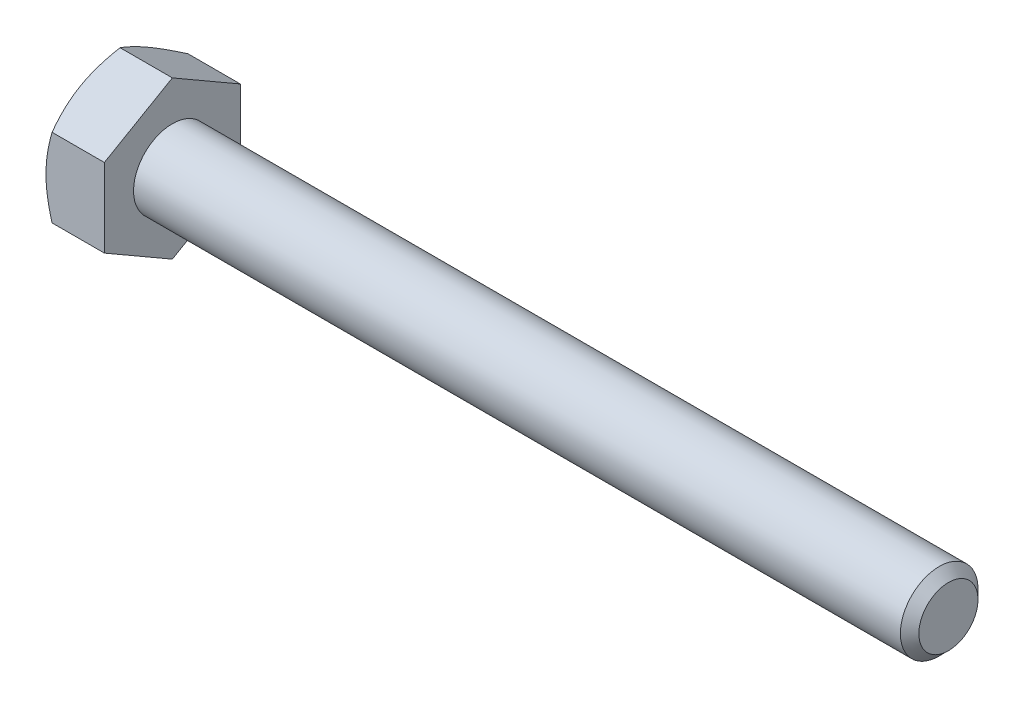
ISO-10303-21;
HEADER;
FILE_DESCRIPTION(('STEP AP214'),'2;1');
FILE_NAME('part.step','',(''),(''),'','','');
FILE_SCHEMA(('AUTOMOTIVE_DESIGN { 1 0 10303 214 1 1 1 1 }'));
ENDSEC;
DATA;
#1=APPLICATION_CONTEXT('core data for automotive mechanical design processes');
#2=APPLICATION_PROTOCOL_DEFINITION('international standard','automotive_design',2000,#1);
#3=PRODUCT_CONTEXT('',#1,'mechanical');
#4=PRODUCT('Part','Part','',(#3));
#5=PRODUCT_RELATED_PRODUCT_CATEGORY('part','',(#4));
#6=PRODUCT_DEFINITION_FORMATION('','',#4);
#7=PRODUCT_DEFINITION_CONTEXT('part definition',#1,'design');
#8=PRODUCT_DEFINITION('design','',#6,#7);
#9=PRODUCT_DEFINITION_SHAPE('','',#8);
#10=(LENGTH_UNIT() NAMED_UNIT(*) SI_UNIT(.MILLI.,.METRE.));
#11=(NAMED_UNIT(*) PLANE_ANGLE_UNIT() SI_UNIT($,.RADIAN.));
#12=(NAMED_UNIT(*) SI_UNIT($,.STERADIAN.) SOLID_ANGLE_UNIT());
#13=UNCERTAINTY_MEASURE_WITH_UNIT(LENGTH_MEASURE(1.E-05),#10,'distance_accuracy_value','');
#14=(GEOMETRIC_REPRESENTATION_CONTEXT(3) GLOBAL_UNCERTAINTY_ASSIGNED_CONTEXT((#13)) GLOBAL_UNIT_ASSIGNED_CONTEXT((#10,
#11,#12)) REPRESENTATION_CONTEXT('',''));
#15=CARTESIAN_POINT('',(0.,0.,0.));
#16=DIRECTION('',(0.,0.,1.));
#17=DIRECTION('',(1.,0.,0.));
#18=AXIS2_PLACEMENT_3D('',#15,#16,#17);
#19=CARTESIAN_POINT('',(4.7752,3.21156860739421,-5.5626));
#20=DIRECTION('',(0.,-0.866025403784438,0.500000000000001));
#21=DIRECTION('',(0.,-0.500000000000001,-0.866025403784438));
#22=AXIS2_PLACEMENT_3D('',#19,#20,#21);
#23=PLANE('',#22);
#24=CARTESIAN_POINT('',(0.496898061070143,6.42325268484227,0.0002));
#25=CARTESIAN_POINT('',(0.45614620225513,6.35265858120791,-0.122072574209491));
#26=CARTESIAN_POINT('',(0.417243775308723,6.2818012683745,-0.244801040124762));
#27=CARTESIAN_POINT('',(0.343647161560542,6.13951120287093,-0.491254662989243));
#28=CARTESIAN_POINT('',(0.308954790139044,6.06807821602765,-0.614980225538197));
#29=CARTESIAN_POINT('',(0.211873701066855,5.85263550648139,-0.98813794459262));
#30=CARTESIAN_POINT('',(0.156654841923373,5.70777535201369,-1.23904309212296));
#31=CARTESIAN_POINT('',(0.0919037861815275,5.49099476252075,-1.61451808721946));
#32=CARTESIAN_POINT('',(0.0734579983429333,5.41972205873199,-1.7379660313744));
#33=CARTESIAN_POINT('',(0.0425268916674615,5.27685459691414,-1.98541973399132));
#34=CARTESIAN_POINT('',(0.030041046189008,5.20525986790488,-2.10942544218948));
#35=CARTESIAN_POINT('',(0.0113480299394708,5.06194605565757,-2.35765224642821));
#36=CARTESIAN_POINT('',(0.00513373340584708,4.9902272065059,-2.48187293701928));
#37=CARTESIAN_POINT('',(-0.000889599359095551,4.84672720555795,-2.7304222295473));
#38=CARTESIAN_POINT('',(-0.000698833448296274,4.7749460557547,-2.85475082803225));
#39=CARTESIAN_POINT('',(0.00862810136342285,4.57828637012706,-3.19537539533985));
#40=CARTESIAN_POINT('',(0.0242873955350757,4.4534722013835,-3.41155987710816));
#41=CARTESIAN_POINT('',(0.0739443233816052,4.20467287416474,-3.84249295274001));
#42=CARTESIAN_POINT('',(0.107958931423458,4.08068859075412,-4.05724003094723));
#43=CARTESIAN_POINT('',(0.192986041409677,3.83138850679899,-4.4890404426887));
#44=CARTESIAN_POINT('',(0.244358813937401,3.70610416511176,-4.70603928788379));
#45=CARTESIAN_POINT('',(0.360954456999593,3.45740388365365,-5.13680081122592));
#46=CARTESIAN_POINT('',(0.426149937617058,3.33398475856357,-5.35056900650764));
#47=CARTESIAN_POINT('',(0.496898061070137,3.21145313734037,-5.5628));
#48=B_SPLINE_CURVE_WITH_KNOTS('',3,(#24,#25,#26,#27,#28,#29,#30,#31,#32,#33,#34,#35,#36,#37,#38,
#39,#40,#41,#42,#43,#44,#45,#46,#47),.UNSPECIFIED.,.F.,.F.,(4,2,2,2,2,2,2,2,2,2,2,4),(0.,
0.44082011856227,0.8818296488474,1.76568130465017,2.19678242164486,2.62784543796583,
3.05841812523868,3.48897751176353,4.23854798324166,4.98881282275669,5.75571809391027,
6.52111769989992),.UNSPECIFIED.);
#49=CARTESIAN_POINT('',(0.496831392605788,6.42313721478843,0.));
#50=VERTEX_POINT('',#49);
#51=CARTESIAN_POINT('',(0.,4.81735291109131,-2.78130000000001));
#52=VERTEX_POINT('',#51);
#53=EDGE_CURVE('E60',#50,#52,#48,.T.);
#54=ORIENTED_EDGE('',*,*,#53,.F.);
#55=DIRECTION('',(-1.,0.,0.));
#56=VECTOR('',#55,1.);
#57=CARTESIAN_POINT('',(4.7752,6.42313721478843,0.));
#58=LINE('',#57,#56);
#59=CARTESIAN_POINT('',(4.7752,6.42313721478843,0.));
#60=VERTEX_POINT('',#59);
#61=EDGE_CURVE('E169',#60,#50,#58,.T.);
#62=ORIENTED_EDGE('',*,*,#61,.F.);
#63=DIRECTION('',(0.,0.500000000000001,0.866025403784438));
#64=VECTOR('',#63,1.);
#65=CARTESIAN_POINT('',(4.7752,3.21156860739421,-5.5626));
#66=LINE('',#65,#64);
#67=CARTESIAN_POINT('',(4.7752,3.21156860739421,-5.5626));
#68=VERTEX_POINT('',#67);
#69=EDGE_CURVE('E271',#68,#60,#66,.T.);
#70=ORIENTED_EDGE('',*,*,#69,.F.);
#71=DIRECTION('',(-1.,0.,0.));
#72=VECTOR('',#71,1.);
#73=CARTESIAN_POINT('',(4.7752,3.21156860739421,-5.5626));
#74=LINE('',#73,#72);
#75=CARTESIAN_POINT('',(0.496831392605783,3.21156860739421,-5.5626));
#76=VERTEX_POINT('',#75);
#77=EDGE_CURVE('E154',#68,#76,#74,.T.);
#78=ORIENTED_EDGE('',*,*,#77,.T.);
#79=EDGE_CURVE('E148',#52,#76,#48,.T.);
#80=ORIENTED_EDGE('',*,*,#79,.F.);
#81=EDGE_LOOP('',(#54,#62,#70,#78,#80));
#82=FACE_BOUND('',#81,.T.);
#83=ADVANCED_FACE('F40',(#82),#23,.F.);
#84=CARTESIAN_POINT('',(4.7752,6.42313721478843,0.));
#85=DIRECTION('',(0.,-0.866025403784438,-0.500000000000001));
#86=DIRECTION('',(0.,0.500000000000001,-0.866025403784438));
#87=AXIS2_PLACEMENT_3D('',#84,#85,#86);
#88=PLANE('',#87);
#89=CARTESIAN_POINT('',(0.496898061070137,3.21145313734037,5.5628));
#90=CARTESIAN_POINT('',(0.456146202255126,3.28204724097473,5.44052742579051));
#91=CARTESIAN_POINT('',(0.417243775308719,3.35290455380814,5.31779895987524));
#92=CARTESIAN_POINT('',(0.343647161560538,3.49519461931171,5.07134533701076));
#93=CARTESIAN_POINT('',(0.30895479013904,3.56662760615498,4.9476197744618));
#94=CARTESIAN_POINT('',(0.211873701066851,3.78207031570124,4.57446205540738));
#95=CARTESIAN_POINT('',(0.156654841923371,3.92693047016895,4.32355690787704));
#96=CARTESIAN_POINT('',(0.0919037861815261,4.14371105966188,3.94808191278055));
#97=CARTESIAN_POINT('',(0.0734579983429319,4.21498376345064,3.82463396862561));
#98=CARTESIAN_POINT('',(0.0425268916674603,4.35785122526849,3.57718026600868));
#99=CARTESIAN_POINT('',(0.0300410461890069,4.42944595427775,3.45317455781052));
#100=CARTESIAN_POINT('',(0.0113480299394699,4.57275976652506,3.20494775357179));
#101=CARTESIAN_POINT('',(0.00513373340584611,4.64447861567674,3.08072706298073));
#102=CARTESIAN_POINT('',(-0.000889599359095831,4.78797861662468,2.8321777704527));
#103=CARTESIAN_POINT('',(-0.000698833448295828,4.85975976642794,2.70784917196775));
#104=CARTESIAN_POINT('',(0.00862810136342449,5.05641945205558,2.36722460466016));
#105=CARTESIAN_POINT('',(0.0242873955350772,5.18123362079914,2.15104012289184));
#106=CARTESIAN_POINT('',(0.0739443233816073,5.4300329480179,1.72010704725999));
#107=CARTESIAN_POINT('',(0.107958931423461,5.55401723142852,1.50535996905277));
#108=CARTESIAN_POINT('',(0.19298604140968,5.80331731538365,1.0735595573113));
#109=CARTESIAN_POINT('',(0.244358813937405,5.92860165707088,0.856560712116213));
#110=CARTESIAN_POINT('',(0.360954456999597,6.17730193852899,0.425799188774084));
#111=CARTESIAN_POINT('',(0.426149937617063,6.30072106361907,0.212030993492364));
#112=CARTESIAN_POINT('',(0.496898061070143,6.42325268484227,-0.000200000000000001));
#113=B_SPLINE_CURVE_WITH_KNOTS('',3,(#89,#90,#91,#92,#93,#94,#95,#96,#97,#98,#99,#100,#101,#102,
#103,#104,#105,#106,#107,#108,#109,#110,#111,#112),.UNSPECIFIED.,.F.,.F.,(4,2,2,2,2,2,2,2,2,2,2,
4),(0.,0.440820118562269,0.881829648847399,1.76568130465016,2.19678242164486,2.62784543796582,
3.05841812523867,3.48897751176352,4.23854798324166,4.98881282275669,5.75571809391027,
6.52111769989992),.UNSPECIFIED.);
#114=CARTESIAN_POINT('',(0.496831392605783,3.21156860739421,5.5626));
#115=VERTEX_POINT('',#114);
#116=CARTESIAN_POINT('',(0.,4.81735291109131,2.78130000000001));
#117=VERTEX_POINT('',#116);
#118=EDGE_CURVE('E67',#115,#117,#113,.T.);
#119=ORIENTED_EDGE('',*,*,#118,.F.);
#120=DIRECTION('',(-1.,0.,0.));
#121=VECTOR('',#120,1.);
#122=CARTESIAN_POINT('',(4.7752,3.21156860739421,5.5626));
#123=LINE('',#122,#121);
#124=CARTESIAN_POINT('',(4.7752,3.21156860739421,5.5626));
#125=VERTEX_POINT('',#124);
#126=EDGE_CURVE('E166',#125,#115,#123,.T.);
#127=ORIENTED_EDGE('',*,*,#126,.F.);
#128=DIRECTION('',(0.,-0.500000000000001,0.866025403784438));
#129=VECTOR('',#128,1.);
#130=CARTESIAN_POINT('',(4.7752,6.42313721478843,0.));
#131=LINE('',#130,#129);
#132=EDGE_CURVE('E268',#60,#125,#131,.T.);
#133=ORIENTED_EDGE('',*,*,#132,.F.);
#134=ORIENTED_EDGE('',*,*,#61,.T.);
#135=EDGE_CURVE('E196',#117,#50,#113,.T.);
#136=ORIENTED_EDGE('',*,*,#135,.F.);
#137=EDGE_LOOP('',(#119,#127,#133,#134,#136));
#138=FACE_BOUND('',#137,.T.);
#139=ADVANCED_FACE('F202',(#138),#88,.F.);
#140=CARTESIAN_POINT('',(4.7752,3.21156860739421,5.5626));
#141=DIRECTION('',(0.,0.,-1.));
#142=DIRECTION('',(0.,1.,0.));
#143=AXIS2_PLACEMENT_3D('',#140,#141,#142);
#144=PLANE('',#143);
#145=CARTESIAN_POINT('',(2.76946298300578,-8.7393190750818,5.5626));
#146=CARTESIAN_POINT('',(2.65067477861527,-8.49536496655185,5.5626));
#147=CARTESIAN_POINT('',(2.53299354463682,-8.25086273482907,5.5626));
#148=CARTESIAN_POINT('',(2.30046552472367,-7.7604709003827,5.5626));
#149=CARTESIAN_POINT('',(2.18561916460972,-7.51458109596807,5.5626));
#150=CARTESIAN_POINT('',(1.9588276573177,-7.01990967875911,5.5626));
#151=CARTESIAN_POINT('',(1.84690075513499,-6.77111967311546,5.5626));
#152=CARTESIAN_POINT('',(1.62748022476041,-6.27159952967086,5.5626));
#153=CARTESIAN_POINT('',(1.51998639425647,-6.02086948102923,5.5626));
#154=CARTESIAN_POINT('',(1.30708686388974,-5.50862062722722,5.5626));
#155=CARTESIAN_POINT('',(1.20187213532634,-5.24702202923404,5.5626));
#156=CARTESIAN_POINT('',(0.999136459179914,-4.72080610855177,5.5626));
#157=CARTESIAN_POINT('',(0.901616358819185,-4.45618845710902,5.5626));
#158=CARTESIAN_POINT('',(0.716747077259983,-3.92397402708936,5.5626));
#159=CARTESIAN_POINT('',(0.629378259967496,-3.65638413524642,5.5626));
#160=CARTESIAN_POINT('',(0.467540995587162,-3.11736467473257,5.5626));
#161=CARTESIAN_POINT('',(0.393068604009403,-2.84593630766607,5.5626));
#162=CARTESIAN_POINT('',(0.260913640631057,-2.30059524064209,5.5626));
#163=CARTESIAN_POINT('',(0.203137923936712,-2.02670547200284,5.5626));
#164=CARTESIAN_POINT('',(0.107584140927259,-1.47536640564423,5.5626));
#165=CARTESIAN_POINT('',(0.0698039297389937,-1.19791749297778,5.5626));
#166=CARTESIAN_POINT('',(0.0306329032322198,-0.782024036094212,5.5626));
#167=CARTESIAN_POINT('',(0.0205033243625241,-0.644369602420743,5.5626));
#168=CARTESIAN_POINT('',(0.00607539244269754,-0.368760083391723,5.5626));
#169=CARTESIAN_POINT('',(0.00177648777087112,-0.230805027714104,5.5626));
#170=CARTESIAN_POINT('',(-0.000882415982739105,0.0451740127451351,5.5626));
#171=CARTESIAN_POINT('',(0.000758104232646437,0.183198002498892,5.5626));
#172=CARTESIAN_POINT('',(0.0099357013266243,0.459040079963629,5.5626));
#173=CARTESIAN_POINT('',(0.017472551860389,0.596858175374894,5.5626));
#174=CARTESIAN_POINT('',(0.0422505229084576,0.924672768817545,5.5626));
#175=CARTESIAN_POINT('',(0.0620998983879061,1.11447655248114,5.5626));
#176=CARTESIAN_POINT('',(0.111925243816852,1.49274006022234,5.5626));
#177=CARTESIAN_POINT('',(0.141902493413722,1.68119961138342,5.5626));
#178=CARTESIAN_POINT('',(0.24544179513394,2.24430469271528,5.5626));
#179=CARTESIAN_POINT('',(0.332595182135706,2.61648784181075,5.5626));
#180=CARTESIAN_POINT('',(0.484580657527375,3.17327423362328,5.5626));
#181=CARTESIAN_POINT('',(0.53953514834987,3.3607403414357,5.5626));
#182=CARTESIAN_POINT('',(0.655361857948686,3.73385345534553,5.5626));
#183=CARTESIAN_POINT('',(0.716234121733455,3.91950044759557,5.5626));
#184=CARTESIAN_POINT('',(0.842902269493743,4.28903174270243,5.5626));
#185=CARTESIAN_POINT('',(0.908696734383907,4.47291653649099,5.5626));
#186=CARTESIAN_POINT('',(1.04441413366768,4.83914665056041,5.5626));
#187=CARTESIAN_POINT('',(1.11433697738278,5.02149200455408,5.5626));
#188=CARTESIAN_POINT('',(1.30616254258249,5.50788800286082,5.5626));
#189=CARTESIAN_POINT('',(1.43118964362203,5.81070522079332,5.5626));
#190=CARTESIAN_POINT('',(1.68847909941209,6.41326146735257,5.5626));
#191=CARTESIAN_POINT('',(1.82074222486502,6.71300016403481,5.5626));
#192=CARTESIAN_POINT('',(2.09080854484645,7.31009693194883,5.5626));
#193=CARTESIAN_POINT('',(2.2286137757305,7.6074540790974,5.5626));
#194=CARTESIAN_POINT('',(2.50845292691855,8.200151033603,5.5626));
#195=CARTESIAN_POINT('',(2.65048668230203,8.49549091908618,5.5626));
#196=CARTESIAN_POINT('',(2.93809441213762,9.08501121353831,5.5626));
#197=CARTESIAN_POINT('',(3.08367358186693,9.37918908275013,5.5626));
#198=CARTESIAN_POINT('',(3.37748078904249,9.96621951864085,5.5626));
#199=CARTESIAN_POINT('',(3.52570884757214,10.2590720747479,5.5626));
#200=CARTESIAN_POINT('',(3.97349977904317,11.1358830052649,5.5626));
#201=CARTESIAN_POINT('',(4.27623214178692,11.7182219945537,5.5626));
#202=CARTESIAN_POINT('',(4.85550678228881,12.8193647810355,5.5626));
#203=CARTESIAN_POINT('',(5.13148986853602,13.3384641758492,5.5626));
#204=CARTESIAN_POINT('',(5.68680572895233,14.3749069872875,5.5626));
#205=CARTESIAN_POINT('',(5.96613870161307,14.8922502975047,5.5626));
#206=CARTESIAN_POINT('',(6.52636532741208,15.9238879385591,5.5626));
#207=CARTESIAN_POINT('',(6.80725083144907,16.4381867017065,5.5626));
#208=CARTESIAN_POINT('',(7.37092859266393,17.4656872191565,5.5626));
#209=CARTESIAN_POINT('',(7.65372070150566,17.9788890548015,5.5626));
#210=CARTESIAN_POINT('',(7.93720779623422,18.4917042787924,5.5626));
#211=B_SPLINE_CURVE_WITH_KNOTS('',3,(#145,#146,#147,#148,#149,#150,#151,#152,#153,#154,#155,
#156,#157,#158,#159,#160,#161,#162,#163,#164,#165,#166,#167,#168,#169,#170,#171,#172,#173,#174,
#175,#176,#177,#178,#179,#180,#181,#182,#183,#184,#185,#186,#187,#188,#189,#190,#191,#192,#193,
#194,#195,#196,#197,#198,#199,#200,#201,#202,#203,#204,#205,#206,#207,#208,#209,#210),
.UNSPECIFIED.,.F.,.F.,(4,2,2,2,2,2,2,2,2,2,2,2,2,2,2,2,2,2,2,2,2,2,2,2,2,2,2,2,2,2,2,2,4),(0.,
0.814023059896039,1.62816765754195,2.44655638702215,3.26490772627512,4.11070764230637,
4.95660055613667,5.80082897545883,6.64479872196119,7.48396511886282,8.32304148200848,
8.73701668482869,9.15095272002817,9.56492494745271,9.97888128433686,10.5510771721585,
11.1233453834466,12.2684477479276,12.8544603660259,13.4404774414739,14.0263262127401,
14.6121621208114,15.5948602808078,16.5776633116356,17.5608308169621,18.5439600269871,
19.5286286939573,20.5133052017346,22.4822323672198,24.245931208995,26.0097350771296,
27.7677407362569,29.5256111634693),.UNSPECIFIED.);
#212=CARTESIAN_POINT('',(0.496831392605779,-3.21156860739419,5.5626));
#213=VERTEX_POINT('',#212);
#214=CARTESIAN_POINT('',(0.,0.,5.5626));
#215=VERTEX_POINT('',#214);
#216=EDGE_CURVE('E285',#213,#215,#211,.T.);
#217=ORIENTED_EDGE('',*,*,#216,.F.);
#218=DIRECTION('',(-1.,0.,0.));
#219=VECTOR('',#218,1.);
#220=CARTESIAN_POINT('',(4.7752,-3.21156860739419,5.5626));
#221=LINE('',#220,#219);
#222=CARTESIAN_POINT('',(4.7752,-3.21156860739419,5.5626));
#223=VERTEX_POINT('',#222);
#224=EDGE_CURVE('E156',#223,#213,#221,.T.);
#225=ORIENTED_EDGE('',*,*,#224,.F.);
#226=DIRECTION('',(0.,-1.,0.));
#227=VECTOR('',#226,1.);
#228=CARTESIAN_POINT('',(4.7752,3.21156860739421,5.5626));
#229=LINE('',#228,#227);
#230=EDGE_CURVE('E263',#125,#223,#229,.T.);
#231=ORIENTED_EDGE('',*,*,#230,.F.);
#232=ORIENTED_EDGE('',*,*,#126,.T.);
#233=EDGE_CURVE('E220',#215,#115,#211,.T.);
#234=ORIENTED_EDGE('',*,*,#233,.F.);
#235=EDGE_LOOP('',(#217,#225,#231,#232,#234));
#236=FACE_BOUND('',#235,.T.);
#237=ADVANCED_FACE('F293',(#236),#144,.F.);
#238=CARTESIAN_POINT('',(4.7752,-6.42313721478842,0.));
#239=DIRECTION('',(0.,0.866025403784438,-0.500000000000002));
#240=DIRECTION('',(0.,0.500000000000002,0.866025403784438));
#241=AXIS2_PLACEMENT_3D('',#238,#239,#240);
#242=PLANE('',#241);
#243=CARTESIAN_POINT('',(0.496898061070138,-6.42325268484226,-0.000200000000000038));
#244=CARTESIAN_POINT('',(0.456146202255126,-6.3526585812079,0.122072574209491));
#245=CARTESIAN_POINT('',(0.417243775308719,-6.28180126837449,0.244801040124762));
#246=CARTESIAN_POINT('',(0.343647161560538,-6.13951120287092,0.491254662989243));
#247=CARTESIAN_POINT('',(0.30895479013904,-6.06807821602765,0.614980225538197));
#248=CARTESIAN_POINT('',(0.21187370106685,-5.85263550648139,0.988137944592619));
#249=CARTESIAN_POINT('',(0.156654841923369,-5.70777535201368,1.23904309212296));
#250=CARTESIAN_POINT('',(0.0919037861815231,-5.49099476252075,1.61451808721945));
#251=CARTESIAN_POINT('',(0.0734579983429287,-5.41972205873199,1.73796603137439));
#252=CARTESIAN_POINT('',(0.0425268916674567,-5.27685459691413,1.98541973399132));
#253=CARTESIAN_POINT('',(0.0300410461890033,-5.20525986790488,2.10942544218948));
#254=CARTESIAN_POINT('',(0.0113480299394658,-5.06194605565756,2.35765224642821));
#255=CARTESIAN_POINT('',(0.00513373340584158,-4.99022720650589,2.48187293701927));
#256=CARTESIAN_POINT('',(-0.00088959935910106,-4.84672720555795,2.73042222954729));
#257=CARTESIAN_POINT('',(-0.000698833448301401,-4.77494605575469,2.85475082803225));
#258=CARTESIAN_POINT('',(0.00862810136341809,-4.57828637012705,3.19537539533984));
#259=CARTESIAN_POINT('',(0.0242873955350705,-4.45347220138349,3.41155987710816));
#260=CARTESIAN_POINT('',(0.0739443233815994,-4.20467287416473,3.84249295274001));
#261=CARTESIAN_POINT('',(0.107958931423452,-4.08068859075411,4.05724003094722));
#262=CARTESIAN_POINT('',(0.192986041409671,-3.83138850679897,4.48904044268869));
#263=CARTESIAN_POINT('',(0.244358813937396,-3.70610416511175,4.70603928788379));
#264=CARTESIAN_POINT('',(0.360954456999589,-3.45740388365364,5.13680081122591));
#265=CARTESIAN_POINT('',(0.426149937617054,-3.33398475856356,5.35056900650764));
#266=CARTESIAN_POINT('',(0.496898061070133,-3.21145313734036,5.5628));
#267=B_SPLINE_CURVE_WITH_KNOTS('',3,(#243,#244,#245,#246,#247,#248,#249,#250,#251,#252,#253,
#254,#255,#256,#257,#258,#259,#260,#261,#262,#263,#264,#265,#266),.UNSPECIFIED.,.F.,.F.,(4,2,2,
2,2,2,2,2,2,2,2,4),(0.,0.44082011856227,0.881829648847399,1.76568130465016,2.19678242164486,
2.62784543796583,3.05841812523868,3.48897751176352,4.23854798324166,4.98881282275669,
5.75571809391028,6.52111769989993),.UNSPECIFIED.);
#268=CARTESIAN_POINT('',(0.496831392605783,-6.42313721478842,0.));
#269=VERTEX_POINT('',#268);
#270=CARTESIAN_POINT('',(0.,-4.81735291109131,2.78130000000001));
#271=VERTEX_POINT('',#270);
#272=EDGE_CURVE('E204',#269,#271,#267,.T.);
#273=ORIENTED_EDGE('',*,*,#272,.F.);
#274=DIRECTION('',(-1.,0.,0.));
#275=VECTOR('',#274,1.);
#276=CARTESIAN_POINT('',(4.7752,-6.42313721478842,0.));
#277=LINE('',#276,#275);
#278=CARTESIAN_POINT('',(4.7752,-6.42313721478842,0.));
#279=VERTEX_POINT('',#278);
#280=EDGE_CURVE('E153',#279,#269,#277,.T.);
#281=ORIENTED_EDGE('',*,*,#280,.F.);
#282=DIRECTION('',(0.,-0.500000000000002,-0.866025403784438));
#283=VECTOR('',#282,1.);
#284=CARTESIAN_POINT('',(4.7752,-6.42313721478842,0.));
#285=LINE('',#284,#283);
#286=EDGE_CURVE('E260',#223,#279,#285,.T.);
#287=ORIENTED_EDGE('',*,*,#286,.F.);
#288=ORIENTED_EDGE('',*,*,#224,.T.);
#289=EDGE_CURVE('E208',#271,#213,#267,.T.);
#290=ORIENTED_EDGE('',*,*,#289,.F.);
#291=EDGE_LOOP('',(#273,#281,#287,#288,#290));
#292=FACE_BOUND('',#291,.T.);
#293=ADVANCED_FACE('F256',(#292),#242,.F.);
#294=CARTESIAN_POINT('',(4.7752,-3.21156860739422,-5.5626));
#295=DIRECTION('',(0.,0.866025403784439,0.499999999999999));
#296=DIRECTION('',(0.,-0.499999999999999,0.866025403784439));
#297=AXIS2_PLACEMENT_3D('',#294,#295,#296);
#298=PLANE('',#297);
#299=CARTESIAN_POINT('',(0.49689806107014,-3.21145313734038,-5.5628));
#300=CARTESIAN_POINT('',(0.456146202255128,-3.28204724097474,-5.44052742579051));
#301=CARTESIAN_POINT('',(0.417243775308721,-3.35290455380815,-5.31779895987524));
#302=CARTESIAN_POINT('',(0.343647161560541,-3.49519461931171,-5.07134533701076));
#303=CARTESIAN_POINT('',(0.308954790139042,-3.56662760615499,-4.9476197744618));
#304=CARTESIAN_POINT('',(0.211873701066853,-3.78207031570125,-4.57446205540738));
#305=CARTESIAN_POINT('',(0.156654841923372,-3.92693047016895,-4.32355690787704));
#306=CARTESIAN_POINT('',(0.0919037861815272,-4.14371105966189,-3.94808191278054));
#307=CARTESIAN_POINT('',(0.0734579983429331,-4.21498376345065,-3.8246339686256));
#308=CARTESIAN_POINT('',(0.0425268916674613,-4.3578512252685,-3.57718026600868));
#309=CARTESIAN_POINT('',(0.0300410461890077,-4.42944595427776,-3.45317455781052));
#310=CARTESIAN_POINT('',(0.0113480299394704,-4.57275976652507,-3.20494775357179));
#311=CARTESIAN_POINT('',(0.00513373340584659,-4.64447861567674,-3.08072706298072));
#312=CARTESIAN_POINT('',(-0.000889599359095559,-4.78797861662469,-2.8321777704527));
#313=CARTESIAN_POINT('',(-0.000698833448295763,-4.85975976642794,-2.70784917196775));
#314=CARTESIAN_POINT('',(0.00862810136342402,-5.05641945205558,-2.36722460466015));
#315=CARTESIAN_POINT('',(0.0242873955350764,-5.18123362079914,-2.15104012289184));
#316=CARTESIAN_POINT('',(0.0739443233816055,-5.4300329480179,-1.72010704725999));
#317=CARTESIAN_POINT('',(0.107958931423458,-5.55401723142852,-1.50535996905277));
#318=CARTESIAN_POINT('',(0.192986041409677,-5.80331731538365,-1.0735595573113));
#319=CARTESIAN_POINT('',(0.244358813937401,-5.92860165707087,-0.856560712116213));
#320=CARTESIAN_POINT('',(0.360954456999593,-6.17730193852898,-0.425799188774084));
#321=CARTESIAN_POINT('',(0.426149937617058,-6.30072106361906,-0.212030993492364));
#322=CARTESIAN_POINT('',(0.496898061070137,-6.42325268484226,0.000199999999999785));
#323=B_SPLINE_CURVE_WITH_KNOTS('',3,(#299,#300,#301,#302,#303,#304,#305,#306,#307,#308,#309,
#310,#311,#312,#313,#314,#315,#316,#317,#318,#319,#320,#321,#322),.UNSPECIFIED.,.F.,.F.,(4,2,2,
2,2,2,2,2,2,2,2,4),(0.,0.44082011856227,0.881829648847399,1.76568130465016,2.19678242164486,
2.62784543796583,3.05841812523868,3.48897751176353,4.23854798324166,4.98881282275669,
5.75571809391027,6.52111769989992),.UNSPECIFIED.);
#324=CARTESIAN_POINT('',(0.496831392605577,-3.21156860739453,-5.5626));
#325=VERTEX_POINT('',#324);
#326=CARTESIAN_POINT('',(0.,-4.81735291109132,-2.7813));
#327=VERTEX_POINT('',#326);
#328=EDGE_CURVE('E129',#325,#327,#323,.T.);
#329=ORIENTED_EDGE('',*,*,#328,.F.);
#330=DIRECTION('',(-1.,0.,0.));
#331=VECTOR('',#330,1.);
#332=CARTESIAN_POINT('',(4.7752,-3.21156860739422,-5.5626));
#333=LINE('',#332,#331);
#334=CARTESIAN_POINT('',(4.7752,-3.21156860739422,-5.5626));
#335=VERTEX_POINT('',#334);
#336=EDGE_CURVE('E144',#335,#325,#333,.T.);
#337=ORIENTED_EDGE('',*,*,#336,.F.);
#338=DIRECTION('',(0.,0.499999999999999,-0.866025403784439));
#339=VECTOR('',#338,1.);
#340=CARTESIAN_POINT('',(4.7752,-3.21156860739422,-5.5626));
#341=LINE('',#340,#339);
#342=EDGE_CURVE('E258',#279,#335,#341,.T.);
#343=ORIENTED_EDGE('',*,*,#342,.F.);
#344=ORIENTED_EDGE('',*,*,#280,.T.);
#345=EDGE_CURVE('E147',#327,#269,#323,.T.);
#346=ORIENTED_EDGE('',*,*,#345,.F.);
#347=EDGE_LOOP('',(#329,#337,#343,#344,#346));
#348=FACE_BOUND('',#347,.T.);
#349=ADVANCED_FACE('F142',(#348),#298,.F.);
#350=CARTESIAN_POINT('',(4.7752,3.21156860739421,-5.5626));
#351=DIRECTION('',(0.,0.,1.));
#352=DIRECTION('',(0.,-1.,0.));
#353=AXIS2_PLACEMENT_3D('',#350,#351,#352);
#354=PLANE('',#353);
#355=CARTESIAN_POINT('',(2.76946298300579,-8.73931907508182,-5.5626));
#356=CARTESIAN_POINT('',(2.65067477861528,-8.49536496655187,-5.5626));
#357=CARTESIAN_POINT('',(2.53299354463683,-8.25086273482909,-5.5626));
#358=CARTESIAN_POINT('',(2.30046552472368,-7.76047090038273,-5.5626));
#359=CARTESIAN_POINT('',(2.18561916460973,-7.51458109596809,-5.5626));
#360=CARTESIAN_POINT('',(1.95882765731771,-7.01990967875913,-5.5626));
#361=CARTESIAN_POINT('',(1.846900755135,-6.77111967311548,-5.5626));
#362=CARTESIAN_POINT('',(1.62748022476042,-6.27159952967089,-5.5626));
#363=CARTESIAN_POINT('',(1.51998639425648,-6.02086948102925,-5.5626));
#364=CARTESIAN_POINT('',(1.30708686388975,-5.50862062722724,-5.5626));
#365=CARTESIAN_POINT('',(1.20187213532635,-5.24702202923406,-5.5626));
#366=CARTESIAN_POINT('',(0.999136459179921,-4.72080610855179,-5.5626));
#367=CARTESIAN_POINT('',(0.901616358819192,-4.45618845710904,-5.5626));
#368=CARTESIAN_POINT('',(0.716747077259989,-3.92397402708938,-5.5626));
#369=CARTESIAN_POINT('',(0.629378259967502,-3.65638413524644,-5.5626));
#370=CARTESIAN_POINT('',(0.467540995587167,-3.11736467473259,-5.5626));
#371=CARTESIAN_POINT('',(0.393068604009408,-2.84593630766609,-5.5626));
#372=CARTESIAN_POINT('',(0.260913640631061,-2.3005952406421,-5.5626));
#373=CARTESIAN_POINT('',(0.203137923936715,-2.02670547200286,-5.5626));
#374=CARTESIAN_POINT('',(0.107584140927261,-1.47536640564425,-5.5626));
#375=CARTESIAN_POINT('',(0.0698039297389959,-1.19791749297779,-5.5626));
#376=CARTESIAN_POINT('',(0.0306329032322217,-0.782024036094228,-5.5626));
#377=CARTESIAN_POINT('',(0.0205033243625259,-0.644369602420759,-5.5626));
#378=CARTESIAN_POINT('',(0.00607539244269882,-0.368760083391737,-5.5626));
#379=CARTESIAN_POINT('',(0.00177648777087202,-0.230805027714119,-5.5626));
#380=CARTESIAN_POINT('',(-0.000882415982738997,0.0451740127451205,-5.5626));
#381=CARTESIAN_POINT('',(0.000758104232646156,0.183198002498878,-5.5626));
#382=CARTESIAN_POINT('',(0.00993570132662356,0.459040079963614,-5.5626));
#383=CARTESIAN_POINT('',(0.0174725518603882,0.596858175374879,-5.5626));
#384=CARTESIAN_POINT('',(0.0422505229084564,0.924672768817529,-5.5626));
#385=CARTESIAN_POINT('',(0.0620998983879045,1.11447655248113,-5.5626));
#386=CARTESIAN_POINT('',(0.111925243816849,1.49274006022233,-5.5626));
#387=CARTESIAN_POINT('',(0.141902493413719,1.6811996113834,-5.5626));
#388=CARTESIAN_POINT('',(0.245441795133936,2.24430469271526,-5.5626));
#389=CARTESIAN_POINT('',(0.332595182135701,2.61648784181073,-5.5626));
#390=CARTESIAN_POINT('',(0.484580657527369,3.17327423362326,-5.5626));
#391=CARTESIAN_POINT('',(0.539535148349865,3.36074034143568,-5.5626));
#392=CARTESIAN_POINT('',(0.655361857948679,3.7338534553455,-5.5626));
#393=CARTESIAN_POINT('',(0.716234121733449,3.91950044759555,-5.5626));
#394=CARTESIAN_POINT('',(0.842902269493736,4.28903174270241,-5.5626));
#395=CARTESIAN_POINT('',(0.908696734383899,4.47291653649097,-5.5626));
#396=CARTESIAN_POINT('',(1.04441413366767,4.83914665056038,-5.5626));
#397=CARTESIAN_POINT('',(1.11433697738277,5.02149200455406,-5.5626));
#398=CARTESIAN_POINT('',(1.30616254258248,5.5078880028608,-5.5626));
#399=CARTESIAN_POINT('',(1.43118964362202,5.81070522079329,-5.5626));
#400=CARTESIAN_POINT('',(1.68847909941208,6.41326146735254,-5.5626));
#401=CARTESIAN_POINT('',(1.82074222486501,6.71300016403479,-5.5626));
#402=CARTESIAN_POINT('',(2.09080854484644,7.31009693194881,-5.5626));
#403=CARTESIAN_POINT('',(2.22861377573049,7.60745407909738,-5.5626));
#404=CARTESIAN_POINT('',(2.50845292691854,8.20015103360298,-5.5626));
#405=CARTESIAN_POINT('',(2.65048668230202,8.49549091908616,-5.5626));
#406=CARTESIAN_POINT('',(2.93809441213761,9.08501121353829,-5.5626));
#407=CARTESIAN_POINT('',(3.08367358186692,9.37918908275011,-5.5626));
#408=CARTESIAN_POINT('',(3.37748078904248,9.96621951864084,-5.5626));
#409=CARTESIAN_POINT('',(3.52570884757214,10.2590720747478,-5.5626));
#410=CARTESIAN_POINT('',(3.97349977904316,11.1358830052649,-5.5626));
#411=CARTESIAN_POINT('',(4.27623214178691,11.7182219945536,-5.5626));
#412=CARTESIAN_POINT('',(4.8555067822888,12.8193647810355,-5.5626));
#413=CARTESIAN_POINT('',(5.13148986853601,13.3384641758492,-5.5626));
#414=CARTESIAN_POINT('',(5.68680572895232,14.3749069872875,-5.5626));
#415=CARTESIAN_POINT('',(5.96613870161306,14.8922502975047,-5.5626));
#416=CARTESIAN_POINT('',(6.52636532741208,15.9238879385591,-5.5626));
#417=CARTESIAN_POINT('',(6.80725083144907,16.4381867017065,-5.5626));
#418=CARTESIAN_POINT('',(7.37092859266394,17.4656872191565,-5.5626));
#419=CARTESIAN_POINT('',(7.65372070150567,17.9788890548015,-5.5626));
#420=CARTESIAN_POINT('',(7.93720779623422,18.4917042787924,-5.5626));
#421=B_SPLINE_CURVE_WITH_KNOTS('',3,(#355,#356,#357,#358,#359,#360,#361,#362,#363,#364,#365,
#366,#367,#368,#369,#370,#371,#372,#373,#374,#375,#376,#377,#378,#379,#380,#381,#382,#383,#384,
#385,#386,#387,#388,#389,#390,#391,#392,#393,#394,#395,#396,#397,#398,#399,#400,#401,#402,#403,
#404,#405,#406,#407,#408,#409,#410,#411,#412,#413,#414,#415,#416,#417,#418,#419,#420),
.UNSPECIFIED.,.F.,.F.,(4,2,2,2,2,2,2,2,2,2,2,2,2,2,2,2,2,2,2,2,2,2,2,2,2,2,2,2,2,2,2,2,4),(0.,
0.814023059896039,1.62816765754195,2.44655638702216,3.26490772627512,4.11070764230638,
4.95660055613668,5.80082897545884,6.6447987219612,7.48396511886283,8.32304148200849,
8.7370166848287,9.15095272002818,9.56492494745272,9.97888128433688,10.5510771721585,
11.1233453834466,12.2684477479276,12.8544603660259,13.4404774414739,14.0263262127401,
14.6121621208114,15.5948602808078,16.5776633116356,17.5608308169621,18.5439600269871,
19.5286286939574,20.5133052017346,22.4822323672198,24.245931208995,26.0097350771296,
27.7677407362569,29.5256111634693),.UNSPECIFIED.);
#422=CARTESIAN_POINT('',(0.,0.,-5.5626));
#423=VERTEX_POINT('',#422);
#424=EDGE_CURVE('E136',#76,#423,#421,.F.);
#425=ORIENTED_EDGE('',*,*,#424,.F.);
#426=ORIENTED_EDGE('',*,*,#77,.F.);
#427=DIRECTION('',(0.,1.,0.));
#428=VECTOR('',#427,1.);
#429=CARTESIAN_POINT('',(4.7752,3.21156860739421,-5.5626));
#430=LINE('',#429,#428);
#431=EDGE_CURVE('E152',#335,#68,#430,.T.);
#432=ORIENTED_EDGE('',*,*,#431,.F.);
#433=ORIENTED_EDGE('',*,*,#336,.T.);
#434=EDGE_CURVE('E126',#423,#325,#421,.F.);
#435=ORIENTED_EDGE('',*,*,#434,.F.);
#436=EDGE_LOOP('',(#425,#426,#432,#433,#435));
#437=FACE_BOUND('',#436,.T.);
#438=ADVANCED_FACE('F150',(#437),#354,.F.);
#439=CARTESIAN_POINT('',(4.7752,6.42313721478843,0.));
#440=DIRECTION('',(1.,0.,0.));
#441=DIRECTION('',(0.,0.,-1.));
#442=AXIS2_PLACEMENT_3D('',#439,#440,#441);
#443=PLANE('',#442);
#444=CARTESIAN_POINT('',(4.7752,0.,0.));
#445=DIRECTION('',(1.,0.,0.));
#446=DIRECTION('',(0.,0.,-1.));
#447=AXIS2_PLACEMENT_3D('',#444,#445,#446);
#448=CIRCLE('',#447,3.175);
#449=CARTESIAN_POINT('',(4.7752,0.,-3.175));
#450=VERTEX_POINT('',#449);
#451=EDGE_CURVE('E275',#450,#450,#448,.F.);
#452=ORIENTED_EDGE('',*,*,#451,.T.);
#453=EDGE_LOOP('',(#452));
#454=FACE_BOUND('',#453,.T.);
#455=ORIENTED_EDGE('',*,*,#69,.T.);
#456=ORIENTED_EDGE('',*,*,#132,.T.);
#457=ORIENTED_EDGE('',*,*,#230,.T.);
#458=ORIENTED_EDGE('',*,*,#286,.T.);
#459=ORIENTED_EDGE('',*,*,#342,.T.);
#460=ORIENTED_EDGE('',*,*,#431,.T.);
#461=EDGE_LOOP('',(#455,#456,#457,#458,#459,#460));
#462=FACE_BOUND('',#461,.T.);
#463=ADVANCED_FACE('F295',(#454,#462),#443,.T.);
#464=CARTESIAN_POINT('',(0.,0.,0.));
#465=DIRECTION('',(-1.,0.,0.));
#466=DIRECTION('',(0.,0.,1.));
#467=AXIS2_PLACEMENT_3D('',#464,#465,#466);
#468=CYLINDRICAL_SURFACE('',#467,3.175);
#469=ORIENTED_EDGE('',*,*,#451,.F.);
#470=EDGE_LOOP('',(#469));
#471=FACE_BOUND('',#470,.T.);
#472=CARTESIAN_POINT('',(67.51955,0.,0.));
#473=DIRECTION('',(-1.,0.,0.));
#474=DIRECTION('',(0.,0.,1.));
#475=AXIS2_PLACEMENT_3D('',#472,#473,#474);
#476=CIRCLE('',#475,3.175);
#477=CARTESIAN_POINT('',(67.51955,0.,3.175));
#478=VERTEX_POINT('',#477);
#479=EDGE_CURVE('E279',#478,#478,#476,.T.);
#480=ORIENTED_EDGE('',*,*,#479,.T.);
#481=EDGE_LOOP('',(#480));
#482=FACE_BOUND('',#481,.T.);
#483=ADVANCED_FACE('F326',(#471,#482),#468,.T.);
#484=CARTESIAN_POINT('',(68.2752,0.,0.));
#485=DIRECTION('',(-1.,0.,0.));
#486=DIRECTION('',(0.,0.,1.));
#487=AXIS2_PLACEMENT_3D('',#484,#485,#486);
#488=CONICAL_SURFACE('',#487,2.41935,0.785398163397433);
#489=ORIENTED_EDGE('',*,*,#479,.F.);
#490=EDGE_LOOP('',(#489));
#491=FACE_BOUND('',#490,.T.);
#492=CARTESIAN_POINT('',(68.2752,0.,0.));
#493=DIRECTION('',(-1.,0.,0.));
#494=DIRECTION('',(0.,0.,1.));
#495=AXIS2_PLACEMENT_3D('',#492,#493,#494);
#496=CIRCLE('',#495,2.41935);
#497=CARTESIAN_POINT('',(68.2752,0.,2.41935));
#498=VERTEX_POINT('',#497);
#499=EDGE_CURVE('E282',#498,#498,#496,.T.);
#500=ORIENTED_EDGE('',*,*,#499,.T.);
#501=EDGE_LOOP('',(#500));
#502=FACE_BOUND('',#501,.T.);
#503=ADVANCED_FACE('F329',(#491,#502),#488,.T.);
#504=CARTESIAN_POINT('',(68.2752,0.,0.));
#505=DIRECTION('',(-1.,0.,0.));
#506=DIRECTION('',(0.,0.,1.));
#507=AXIS2_PLACEMENT_3D('',#504,#505,#506);
#508=PLANE('',#507);
#509=ORIENTED_EDGE('',*,*,#499,.F.);
#510=EDGE_LOOP('',(#509));
#511=FACE_BOUND('',#510,.T.);
#512=ADVANCED_FACE('F233',(#511),#508,.F.);
#513=CARTESIAN_POINT('',(0.,0.,0.));
#514=DIRECTION('',(1.,0.,0.));
#515=DIRECTION('',(0.,0.,-1.));
#516=AXIS2_PLACEMENT_3D('',#513,#514,#515);
#517=CONICAL_SURFACE('',#516,5.5626,1.0471975511966);
#518=ORIENTED_EDGE('',*,*,#328,.T.);
#519=CARTESIAN_POINT('',(0.,0.,0.));
#520=DIRECTION('',(1.,0.,0.));
#521=DIRECTION('',(0.,0.,-1.));
#522=AXIS2_PLACEMENT_3D('',#519,#520,#521);
#523=CIRCLE('',#522,5.5626);
#524=EDGE_CURVE('E44',#327,#423,#523,.T.);
#525=ORIENTED_EDGE('',*,*,#524,.T.);
#526=ORIENTED_EDGE('',*,*,#434,.T.);
#527=EDGE_LOOP('',(#518,#525,#526));
#528=FACE_BOUND('',#527,.T.);
#529=ADVANCED_FACE('F128',(#528),#517,.T.);
#530=ORIENTED_EDGE('',*,*,#272,.T.);
#531=EDGE_CURVE('E178',#271,#327,#523,.T.);
#532=ORIENTED_EDGE('',*,*,#531,.T.);
#533=ORIENTED_EDGE('',*,*,#345,.T.);
#534=EDGE_LOOP('',(#530,#532,#533));
#535=FACE_BOUND('',#534,.T.);
#536=ADVANCED_FACE('F232',(#535),#517,.T.);
#537=ORIENTED_EDGE('',*,*,#216,.T.);
#538=EDGE_CURVE('E181',#215,#271,#523,.T.);
#539=ORIENTED_EDGE('',*,*,#538,.T.);
#540=ORIENTED_EDGE('',*,*,#289,.T.);
#541=EDGE_LOOP('',(#537,#539,#540));
#542=FACE_BOUND('',#541,.T.);
#543=ADVANCED_FACE('F227',(#542),#517,.T.);
#544=ORIENTED_EDGE('',*,*,#233,.T.);
#545=ORIENTED_EDGE('',*,*,#118,.T.);
#546=CARTESIAN_POINT('',(0.,0.,0.));
#547=DIRECTION('',(-1.,0.,0.));
#548=DIRECTION('',(0.,0.,1.));
#549=AXIS2_PLACEMENT_3D('',#546,#547,#548);
#550=CIRCLE('',#549,5.5626);
#551=EDGE_CURVE('E137',#215,#117,#550,.T.);
#552=ORIENTED_EDGE('',*,*,#551,.F.);
#553=EDGE_LOOP('',(#544,#545,#552));
#554=FACE_BOUND('',#553,.T.);
#555=ADVANCED_FACE('F231',(#554),#517,.T.);
#556=ORIENTED_EDGE('',*,*,#135,.T.);
#557=ORIENTED_EDGE('',*,*,#53,.T.);
#558=EDGE_CURVE('E50',#52,#117,#523,.T.);
#559=ORIENTED_EDGE('',*,*,#558,.T.);
#560=EDGE_LOOP('',(#556,#557,#559));
#561=FACE_BOUND('',#560,.T.);
#562=ADVANCED_FACE('F195',(#561),#517,.T.);
#563=ORIENTED_EDGE('',*,*,#79,.T.);
#564=ORIENTED_EDGE('',*,*,#424,.T.);
#565=EDGE_CURVE('E11',#423,#52,#523,.T.);
#566=ORIENTED_EDGE('',*,*,#565,.T.);
#567=EDGE_LOOP('',(#563,#564,#566));
#568=FACE_BOUND('',#567,.T.);
#569=ADVANCED_FACE('F298',(#568),#517,.T.);
#570=CARTESIAN_POINT('',(0.,6.42313721478843,0.));
#571=DIRECTION('',(1.,0.,0.));
#572=DIRECTION('',(0.,0.,-1.));
#573=AXIS2_PLACEMENT_3D('',#570,#571,#572);
#574=PLANE('',#573);
#575=ORIENTED_EDGE('',*,*,#565,.F.);
#576=ORIENTED_EDGE('',*,*,#524,.F.);
#577=ORIENTED_EDGE('',*,*,#531,.F.);
#578=ORIENTED_EDGE('',*,*,#538,.F.);
#579=ORIENTED_EDGE('',*,*,#551,.T.);
#580=ORIENTED_EDGE('',*,*,#558,.F.);
#581=EDGE_LOOP('',(#575,#576,#577,#578,#579,#580));
#582=FACE_BOUND('',#581,.T.);
#583=ADVANCED_FACE('F199',(#582),#574,.F.);
#584=CLOSED_SHELL('',(#83,#139,#237,#293,#349,#438,#463,#483,#503,#512,#529,#536,#543,#555,#562,
#569,#583));
#585=MANIFOLD_SOLID_BREP('B2',#584);
#586=ADVANCED_BREP_SHAPE_REPRESENTATION('',(#18,#585),#14);
#587=SHAPE_DEFINITION_REPRESENTATION(#9,#586);
ENDSEC;
END-ISO-10303-21;
